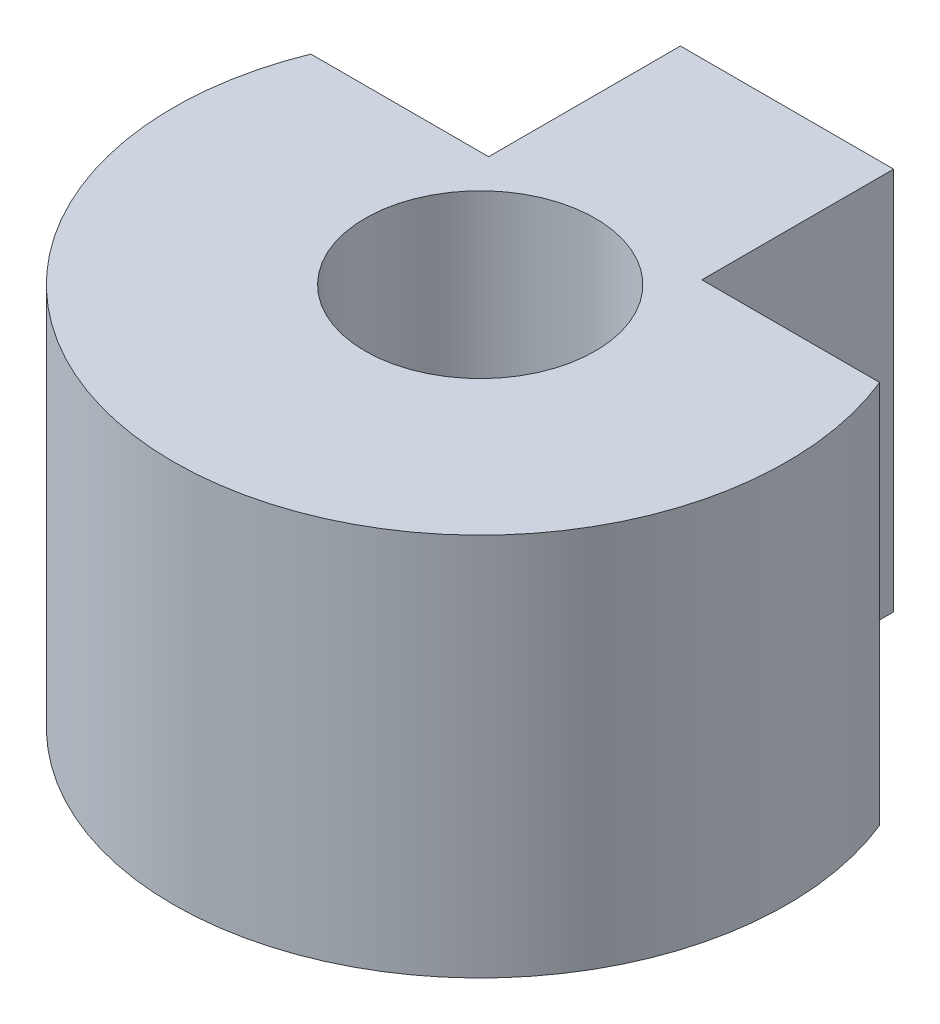
ISO-10303-21;
HEADER;
FILE_DESCRIPTION(('STEP AP214'),'2;1');
FILE_NAME('part.step','',(''),(''),'','','');
FILE_SCHEMA(('AUTOMOTIVE_DESIGN { 1 0 10303 214 1 1 1 1 }'));
ENDSEC;
DATA;
#1=APPLICATION_CONTEXT('core data for automotive mechanical design processes');
#2=APPLICATION_PROTOCOL_DEFINITION('international standard','automotive_design',2000,#1);
#3=PRODUCT_CONTEXT('',#1,'mechanical');
#4=PRODUCT('Part','Part','',(#3));
#5=PRODUCT_RELATED_PRODUCT_CATEGORY('part','',(#4));
#6=PRODUCT_DEFINITION_FORMATION('','',#4);
#7=PRODUCT_DEFINITION_CONTEXT('part definition',#1,'design');
#8=PRODUCT_DEFINITION('design','',#6,#7);
#9=PRODUCT_DEFINITION_SHAPE('','',#8);
#10=(LENGTH_UNIT() NAMED_UNIT(*) SI_UNIT(.MILLI.,.METRE.));
#11=(NAMED_UNIT(*) PLANE_ANGLE_UNIT() SI_UNIT($,.RADIAN.));
#12=(NAMED_UNIT(*) SI_UNIT($,.STERADIAN.) SOLID_ANGLE_UNIT());
#13=UNCERTAINTY_MEASURE_WITH_UNIT(LENGTH_MEASURE(1.E-05),#10,'distance_accuracy_value','');
#14=(GEOMETRIC_REPRESENTATION_CONTEXT(3) GLOBAL_UNCERTAINTY_ASSIGNED_CONTEXT((#13)) GLOBAL_UNIT_ASSIGNED_CONTEXT((#10,
#11,#12)) REPRESENTATION_CONTEXT('',''));
#15=CARTESIAN_POINT('',(0.,0.,0.));
#16=DIRECTION('',(0.,0.,1.));
#17=DIRECTION('',(1.,0.,0.));
#18=AXIS2_PLACEMENT_3D('',#15,#16,#17);
#19=CARTESIAN_POINT('',(0.,6.35,0.));
#20=DIRECTION('',(0.,1.,0.));
#21=DIRECTION('',(0.,0.,1.));
#22=AXIS2_PLACEMENT_3D('',#19,#20,#21);
#23=PLANE('',#22);
#24=DIRECTION('',(-1.,0.,0.));
#25=VECTOR('',#24,1.);
#26=CARTESIAN_POINT('',(-1.7653,6.35,-1.905));
#27=LINE('',#26,#25);
#28=CARTESIAN_POINT('',(-1.7653,6.35,-1.905));
#29=VERTEX_POINT('',#28);
#30=CARTESIAN_POINT('',(-4.70928603930574,6.35,-1.905));
#31=VERTEX_POINT('',#30);
#32=EDGE_CURVE('E128',#29,#31,#27,.T.);
#33=ORIENTED_EDGE('',*,*,#32,.T.);
#34=CARTESIAN_POINT('',(0.,6.35,0.));
#35=DIRECTION('',(0.,1.,0.));
#36=DIRECTION('',(0.,0.,1.));
#37=AXIS2_PLACEMENT_3D('',#34,#35,#36);
#38=CIRCLE('',#37,5.08);
#39=CARTESIAN_POINT('',(4.70928603930574,6.35,-1.905));
#40=VERTEX_POINT('',#39);
#41=EDGE_CURVE('E86',#31,#40,#38,.T.);
#42=ORIENTED_EDGE('',*,*,#41,.T.);
#43=DIRECTION('',(-1.,0.,0.));
#44=VECTOR('',#43,1.);
#45=CARTESIAN_POINT('',(1.7653,6.35,-1.905));
#46=LINE('',#45,#44);
#47=CARTESIAN_POINT('',(1.7653,6.35,-1.905));
#48=VERTEX_POINT('',#47);
#49=EDGE_CURVE('E99',#40,#48,#46,.T.);
#50=ORIENTED_EDGE('',*,*,#49,.T.);
#51=DIRECTION('',(0.,0.,-1.));
#52=VECTOR('',#51,1.);
#53=CARTESIAN_POINT('',(1.7653,6.35,-1.905));
#54=LINE('',#53,#52);
#55=CARTESIAN_POINT('',(1.7653,6.35,-5.08));
#56=VERTEX_POINT('',#55);
#57=EDGE_CURVE('E93',#48,#56,#54,.T.);
#58=ORIENTED_EDGE('',*,*,#57,.T.);
#59=DIRECTION('',(-1.,0.,0.));
#60=VECTOR('',#59,1.);
#61=CARTESIAN_POINT('',(-1.7653,6.35,-5.08));
#62=LINE('',#61,#60);
#63=CARTESIAN_POINT('',(-1.7653,6.35,-5.08));
#64=VERTEX_POINT('',#63);
#65=EDGE_CURVE('E97',#56,#64,#62,.T.);
#66=ORIENTED_EDGE('',*,*,#65,.T.);
#67=DIRECTION('',(0.,0.,1.));
#68=VECTOR('',#67,1.);
#69=CARTESIAN_POINT('',(-1.7653,6.35,-1.905));
#70=LINE('',#69,#68);
#71=EDGE_CURVE('E49',#64,#29,#70,.T.);
#72=ORIENTED_EDGE('',*,*,#71,.T.);
#73=EDGE_LOOP('',(#33,#42,#50,#58,#66,#72));
#74=FACE_BOUND('',#73,.T.);
#75=CARTESIAN_POINT('',(0.,6.35,0.));
#76=DIRECTION('',(0.,1.,0.));
#77=DIRECTION('',(0.,0.,1.));
#78=AXIS2_PLACEMENT_3D('',#75,#76,#77);
#79=CIRCLE('',#78,1.905);
#80=CARTESIAN_POINT('',(0.,6.35,1.905));
#81=VERTEX_POINT('',#80);
#82=EDGE_CURVE('E121',#81,#81,#79,.T.);
#83=ORIENTED_EDGE('',*,*,#82,.F.);
#84=EDGE_LOOP('',(#83));
#85=FACE_BOUND('',#84,.T.);
#86=ADVANCED_FACE('F32',(#74,#85),#23,.T.);
#87=CARTESIAN_POINT('',(0.,0.,0.));
#88=DIRECTION('',(0.,1.,0.));
#89=DIRECTION('',(0.,0.,1.));
#90=AXIS2_PLACEMENT_3D('',#87,#88,#89);
#91=PLANE('',#90);
#92=DIRECTION('',(-1.,0.,0.));
#93=VECTOR('',#92,1.);
#94=CARTESIAN_POINT('',(-1.7653,0.,-1.905));
#95=LINE('',#94,#93);
#96=CARTESIAN_POINT('',(-1.7653,0.,-1.905));
#97=VERTEX_POINT('',#96);
#98=CARTESIAN_POINT('',(-4.70928603930574,0.,-1.905));
#99=VERTEX_POINT('',#98);
#100=EDGE_CURVE('E117',#97,#99,#95,.T.);
#101=ORIENTED_EDGE('',*,*,#100,.F.);
#102=DIRECTION('',(0.,0.,1.));
#103=VECTOR('',#102,1.);
#104=CARTESIAN_POINT('',(-1.7653,0.,-1.905));
#105=LINE('',#104,#103);
#106=CARTESIAN_POINT('',(-1.7653,0.,-5.08));
#107=VERTEX_POINT('',#106);
#108=EDGE_CURVE('E78',#107,#97,#105,.T.);
#109=ORIENTED_EDGE('',*,*,#108,.F.);
#110=DIRECTION('',(-1.,0.,0.));
#111=VECTOR('',#110,1.);
#112=CARTESIAN_POINT('',(-1.7653,0.,-5.08));
#113=LINE('',#112,#111);
#114=CARTESIAN_POINT('',(1.7653,0.,-5.08));
#115=VERTEX_POINT('',#114);
#116=EDGE_CURVE('E72',#115,#107,#113,.T.);
#117=ORIENTED_EDGE('',*,*,#116,.F.);
#118=DIRECTION('',(0.,0.,-1.));
#119=VECTOR('',#118,1.);
#120=CARTESIAN_POINT('',(1.7653,0.,-1.905));
#121=LINE('',#120,#119);
#122=CARTESIAN_POINT('',(1.7653,0.,-1.905));
#123=VERTEX_POINT('',#122);
#124=EDGE_CURVE('E107',#123,#115,#121,.T.);
#125=ORIENTED_EDGE('',*,*,#124,.F.);
#126=DIRECTION('',(-1.,0.,0.));
#127=VECTOR('',#126,1.);
#128=CARTESIAN_POINT('',(1.7653,0.,-1.905));
#129=LINE('',#128,#127);
#130=CARTESIAN_POINT('',(4.70928603930574,0.,-1.905));
#131=VERTEX_POINT('',#130);
#132=EDGE_CURVE('E123',#131,#123,#129,.T.);
#133=ORIENTED_EDGE('',*,*,#132,.F.);
#134=CARTESIAN_POINT('',(0.,0.,0.));
#135=DIRECTION('',(0.,1.,0.));
#136=DIRECTION('',(0.,0.,1.));
#137=AXIS2_PLACEMENT_3D('',#134,#135,#136);
#138=CIRCLE('',#137,5.08);
#139=EDGE_CURVE('E120',#99,#131,#138,.T.);
#140=ORIENTED_EDGE('',*,*,#139,.F.);
#141=EDGE_LOOP('',(#101,#109,#117,#125,#133,#140));
#142=FACE_BOUND('',#141,.T.);
#143=CARTESIAN_POINT('',(0.,0.,0.));
#144=DIRECTION('',(0.,1.,0.));
#145=DIRECTION('',(0.,0.,1.));
#146=AXIS2_PLACEMENT_3D('',#143,#144,#145);
#147=CIRCLE('',#146,1.905);
#148=CARTESIAN_POINT('',(0.,0.,1.905));
#149=VERTEX_POINT('',#148);
#150=EDGE_CURVE('E221',#149,#149,#147,.T.);
#151=ORIENTED_EDGE('',*,*,#150,.T.);
#152=EDGE_LOOP('',(#151));
#153=FACE_BOUND('',#152,.T.);
#154=ADVANCED_FACE('F137',(#142,#153),#91,.F.);
#155=CARTESIAN_POINT('',(-1.7653,6.35,-1.905));
#156=DIRECTION('',(0.,0.,1.));
#157=DIRECTION('',(1.,0.,0.));
#158=AXIS2_PLACEMENT_3D('',#155,#156,#157);
#159=PLANE('',#158);
#160=ORIENTED_EDGE('',*,*,#100,.T.);
#161=DIRECTION('',(0.,-1.,0.));
#162=VECTOR('',#161,1.);
#163=CARTESIAN_POINT('',(-4.70928603930574,6.35,-1.905));
#164=LINE('',#163,#162);
#165=EDGE_CURVE('E11',#31,#99,#164,.T.);
#166=ORIENTED_EDGE('',*,*,#165,.F.);
#167=ORIENTED_EDGE('',*,*,#32,.F.);
#168=DIRECTION('',(0.,-1.,0.));
#169=VECTOR('',#168,1.);
#170=CARTESIAN_POINT('',(-1.7653,6.35,-1.905));
#171=LINE('',#170,#169);
#172=EDGE_CURVE('E113',#29,#97,#171,.T.);
#173=ORIENTED_EDGE('',*,*,#172,.T.);
#174=EDGE_LOOP('',(#160,#166,#167,#173));
#175=FACE_BOUND('',#174,.T.);
#176=ADVANCED_FACE('F34',(#175),#159,.F.);
#177=CARTESIAN_POINT('',(0.,6.35,0.));
#178=DIRECTION('',(0.,-1.,0.));
#179=DIRECTION('',(0.,0.,-1.));
#180=AXIS2_PLACEMENT_3D('',#177,#178,#179);
#181=CYLINDRICAL_SURFACE('',#180,5.08);
#182=ORIENTED_EDGE('',*,*,#139,.T.);
#183=DIRECTION('',(0.,-1.,0.));
#184=VECTOR('',#183,1.);
#185=CARTESIAN_POINT('',(4.70928603930574,6.35,-1.905));
#186=LINE('',#185,#184);
#187=EDGE_CURVE('E41',#40,#131,#186,.T.);
#188=ORIENTED_EDGE('',*,*,#187,.F.);
#189=ORIENTED_EDGE('',*,*,#41,.F.);
#190=ORIENTED_EDGE('',*,*,#165,.T.);
#191=EDGE_LOOP('',(#182,#188,#189,#190));
#192=FACE_BOUND('',#191,.T.);
#193=ADVANCED_FACE('F162',(#192),#181,.T.);
#194=CARTESIAN_POINT('',(1.7653,6.35,-1.905));
#195=DIRECTION('',(0.,0.,1.));
#196=DIRECTION('',(1.,0.,0.));
#197=AXIS2_PLACEMENT_3D('',#194,#195,#196);
#198=PLANE('',#197);
#199=ORIENTED_EDGE('',*,*,#132,.T.);
#200=DIRECTION('',(0.,-1.,0.));
#201=VECTOR('',#200,1.);
#202=CARTESIAN_POINT('',(1.7653,6.35,-1.905));
#203=LINE('',#202,#201);
#204=EDGE_CURVE('E108',#48,#123,#203,.T.);
#205=ORIENTED_EDGE('',*,*,#204,.F.);
#206=ORIENTED_EDGE('',*,*,#49,.F.);
#207=ORIENTED_EDGE('',*,*,#187,.T.);
#208=EDGE_LOOP('',(#199,#205,#206,#207));
#209=FACE_BOUND('',#208,.T.);
#210=ADVANCED_FACE('F134',(#209),#198,.F.);
#211=CARTESIAN_POINT('',(1.7653,6.35,-1.905));
#212=DIRECTION('',(-1.,0.,0.));
#213=DIRECTION('',(0.,0.,1.));
#214=AXIS2_PLACEMENT_3D('',#211,#212,#213);
#215=PLANE('',#214);
#216=ORIENTED_EDGE('',*,*,#124,.T.);
#217=DIRECTION('',(0.,-1.,0.));
#218=VECTOR('',#217,1.);
#219=CARTESIAN_POINT('',(1.7653,6.35,-5.08));
#220=LINE('',#219,#218);
#221=EDGE_CURVE('E104',#56,#115,#220,.T.);
#222=ORIENTED_EDGE('',*,*,#221,.F.);
#223=ORIENTED_EDGE('',*,*,#57,.F.);
#224=ORIENTED_EDGE('',*,*,#204,.T.);
#225=EDGE_LOOP('',(#216,#222,#223,#224));
#226=FACE_BOUND('',#225,.T.);
#227=ADVANCED_FACE('F105',(#226),#215,.F.);
#228=CARTESIAN_POINT('',(-1.7653,6.35,-5.08));
#229=DIRECTION('',(0.,0.,1.));
#230=DIRECTION('',(1.,0.,0.));
#231=AXIS2_PLACEMENT_3D('',#228,#229,#230);
#232=PLANE('',#231);
#233=ORIENTED_EDGE('',*,*,#116,.T.);
#234=DIRECTION('',(0.,-1.,0.));
#235=VECTOR('',#234,1.);
#236=CARTESIAN_POINT('',(-1.7653,6.35,-5.08));
#237=LINE('',#236,#235);
#238=EDGE_CURVE('E109',#64,#107,#237,.T.);
#239=ORIENTED_EDGE('',*,*,#238,.F.);
#240=ORIENTED_EDGE('',*,*,#65,.F.);
#241=ORIENTED_EDGE('',*,*,#221,.T.);
#242=EDGE_LOOP('',(#233,#239,#240,#241));
#243=FACE_BOUND('',#242,.T.);
#244=ADVANCED_FACE('F111',(#243),#232,.F.);
#245=CARTESIAN_POINT('',(-1.7653,6.35,-1.905));
#246=DIRECTION('',(1.,0.,0.));
#247=DIRECTION('',(0.,0.,-1.));
#248=AXIS2_PLACEMENT_3D('',#245,#246,#247);
#249=PLANE('',#248);
#250=ORIENTED_EDGE('',*,*,#108,.T.);
#251=ORIENTED_EDGE('',*,*,#172,.F.);
#252=ORIENTED_EDGE('',*,*,#71,.F.);
#253=ORIENTED_EDGE('',*,*,#238,.T.);
#254=EDGE_LOOP('',(#250,#251,#252,#253));
#255=FACE_BOUND('',#254,.T.);
#256=ADVANCED_FACE('F142',(#255),#249,.F.);
#257=CARTESIAN_POINT('',(0.,6.35,0.));
#258=DIRECTION('',(0.,-1.,0.));
#259=DIRECTION('',(0.,0.,-1.));
#260=AXIS2_PLACEMENT_3D('',#257,#258,#259);
#261=CYLINDRICAL_SURFACE('',#260,1.905);
#262=ORIENTED_EDGE('',*,*,#82,.T.);
#263=EDGE_LOOP('',(#262));
#264=FACE_BOUND('',#263,.T.);
#265=ORIENTED_EDGE('',*,*,#150,.F.);
#266=EDGE_LOOP('',(#265));
#267=FACE_BOUND('',#266,.T.);
#268=ADVANCED_FACE('F144',(#264,#267),#261,.F.);
#269=CLOSED_SHELL('',(#86,#154,#176,#193,#210,#227,#244,#256,#268));
#270=MANIFOLD_SOLID_BREP('B2',#269);
#271=ADVANCED_BREP_SHAPE_REPRESENTATION('',(#18,#270),#14);
#272=SHAPE_DEFINITION_REPRESENTATION(#9,#271);
ENDSEC;
END-ISO-10303-21;
